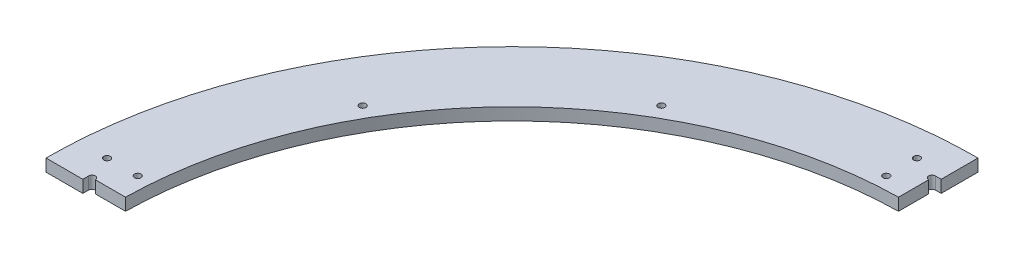
ISO-10303-21;
HEADER;
FILE_DESCRIPTION(('STEP AP214'),'2;1');
FILE_NAME('part.step','',(''),(''),'','','');
FILE_SCHEMA(('AUTOMOTIVE_DESIGN { 1 0 10303 214 1 1 1 1 }'));
ENDSEC;
DATA;
#1=APPLICATION_CONTEXT('core data for automotive mechanical design processes');
#2=APPLICATION_PROTOCOL_DEFINITION('international standard','automotive_design',2000,#1);
#3=PRODUCT_CONTEXT('',#1,'mechanical');
#4=PRODUCT('Part','Part','',(#3));
#5=PRODUCT_RELATED_PRODUCT_CATEGORY('part','',(#4));
#6=PRODUCT_DEFINITION_FORMATION('','',#4);
#7=PRODUCT_DEFINITION_CONTEXT('part definition',#1,'design');
#8=PRODUCT_DEFINITION('design','',#6,#7);
#9=PRODUCT_DEFINITION_SHAPE('','',#8);
#10=(LENGTH_UNIT() NAMED_UNIT(*) SI_UNIT(.MILLI.,.METRE.));
#11=(NAMED_UNIT(*) PLANE_ANGLE_UNIT() SI_UNIT($,.RADIAN.));
#12=(NAMED_UNIT(*) SI_UNIT($,.STERADIAN.) SOLID_ANGLE_UNIT());
#13=UNCERTAINTY_MEASURE_WITH_UNIT(LENGTH_MEASURE(1.E-05),#10,'distance_accuracy_value','');
#14=(GEOMETRIC_REPRESENTATION_CONTEXT(3) GLOBAL_UNCERTAINTY_ASSIGNED_CONTEXT((#13)) GLOBAL_UNIT_ASSIGNED_CONTEXT((#10,
#11,#12)) REPRESENTATION_CONTEXT('',''));
#15=CARTESIAN_POINT('',(0.,0.,0.));
#16=DIRECTION('',(0.,0.,1.));
#17=DIRECTION('',(1.,0.,0.));
#18=AXIS2_PLACEMENT_3D('',#15,#16,#17);
#19=CARTESIAN_POINT('',(0.,0.,0.));
#20=DIRECTION('',(0.,-1.,0.));
#21=DIRECTION('',(0.,0.,-1.));
#22=AXIS2_PLACEMENT_3D('',#19,#20,#21);
#23=PLANE('',#22);
#24=DIRECTION('',(0.,0.,1.));
#25=VECTOR('',#24,1.);
#26=CARTESIAN_POINT('',(-0.317499999999999,0.,-482.6));
#27=LINE('',#26,#25);
#28=CARTESIAN_POINT('',(-0.317499999999999,0.,-482.599895559199));
#29=VERTEX_POINT('',#28);
#30=CARTESIAN_POINT('',(-0.317499999999995,0.,-444.5));
#31=VERTEX_POINT('',#30);
#32=EDGE_CURVE('E109',#29,#31,#27,.T.);
#33=ORIENTED_EDGE('',*,*,#32,.T.);
#34=DIRECTION('',(-1.,0.,0.));
#35=VECTOR('',#34,1.);
#36=CARTESIAN_POINT('',(-6.35,0.,-444.5));
#37=LINE('',#36,#35);
#38=CARTESIAN_POINT('',(-6.35,0.,-444.5));
#39=VERTEX_POINT('',#38);
#40=EDGE_CURVE('E120',#31,#39,#37,.T.);
#41=ORIENTED_EDGE('',*,*,#40,.T.);
#42=CARTESIAN_POINT('',(-6.35,0.,-441.071));
#43=DIRECTION('',(0.,1.,0.));
#44=DIRECTION('',(0.,0.,1.));
#45=AXIS2_PLACEMENT_3D('',#42,#43,#44);
#46=CIRCLE('',#45,3.429);
#47=CARTESIAN_POINT('',(-6.35,0.,-437.642));
#48=VERTEX_POINT('',#47);
#49=EDGE_CURVE('E214',#39,#48,#46,.T.);
#50=ORIENTED_EDGE('',*,*,#49,.T.);
#51=DIRECTION('',(0.,0.,1.));
#52=VECTOR('',#51,1.);
#53=CARTESIAN_POINT('',(-6.35,0.,-406.350387596714));
#54=LINE('',#53,#52);
#55=CARTESIAN_POINT('',(-6.35,0.,-406.350387596714));
#56=VERTEX_POINT('',#55);
#57=EDGE_CURVE('E130',#48,#56,#54,.T.);
#58=ORIENTED_EDGE('',*,*,#57,.T.);
#59=CARTESIAN_POINT('',(0.,0.,0.));
#60=DIRECTION('',(0.,-1.,0.));
#61=DIRECTION('',(0.,0.,-1.));
#62=AXIS2_PLACEMENT_3D('',#59,#60,#61);
#63=CIRCLE('',#62,406.4);
#64=CARTESIAN_POINT('',(-406.350387596714,0.,-6.34999999999993));
#65=VERTEX_POINT('',#64);
#66=EDGE_CURVE('E142',#65,#56,#63,.T.);
#67=ORIENTED_EDGE('',*,*,#66,.F.);
#68=DIRECTION('',(-1.,0.,0.));
#69=VECTOR('',#68,1.);
#70=CARTESIAN_POINT('',(-406.350387596714,0.,-6.34999999999993));
#71=LINE('',#70,#69);
#72=CARTESIAN_POINT('',(-437.642,0.,-6.34999999999992));
#73=VERTEX_POINT('',#72);
#74=EDGE_CURVE('E144',#65,#73,#71,.T.);
#75=ORIENTED_EDGE('',*,*,#74,.T.);
#76=CARTESIAN_POINT('',(-441.071,0.,-6.34999999999992));
#77=DIRECTION('',(0.,1.,0.));
#78=DIRECTION('',(0.,0.,1.));
#79=AXIS2_PLACEMENT_3D('',#76,#77,#78);
#80=CIRCLE('',#79,3.42899999999994);
#81=CARTESIAN_POINT('',(-444.5,0.,-6.34999999999992));
#82=VERTEX_POINT('',#81);
#83=EDGE_CURVE('E215',#73,#82,#80,.T.);
#84=ORIENTED_EDGE('',*,*,#83,.T.);
#85=DIRECTION('',(0.,0.,1.));
#86=VECTOR('',#85,1.);
#87=CARTESIAN_POINT('',(-444.5,0.,6.35000000000008));
#88=LINE('',#87,#86);
#89=CARTESIAN_POINT('',(-444.5,0.,-0.317500000000082));
#90=VERTEX_POINT('',#89);
#91=EDGE_CURVE('E147',#82,#90,#88,.T.);
#92=ORIENTED_EDGE('',*,*,#91,.T.);
#93=DIRECTION('',(-1.,0.,0.));
#94=VECTOR('',#93,1.);
#95=CARTESIAN_POINT('',(-482.6,0.,-0.317500000000082));
#96=LINE('',#95,#94);
#97=CARTESIAN_POINT('',(-482.599895559199,0.,-0.317500000000082));
#98=VERTEX_POINT('',#97);
#99=EDGE_CURVE('E47',#90,#98,#96,.T.);
#100=ORIENTED_EDGE('',*,*,#99,.T.);
#101=CARTESIAN_POINT('',(0.,0.,0.));
#102=DIRECTION('',(0.,1.,0.));
#103=DIRECTION('',(0.,0.,-1.));
#104=AXIS2_PLACEMENT_3D('',#101,#102,#103);
#105=CIRCLE('',#104,482.6);
#106=EDGE_CURVE('E123',#29,#98,#105,.T.);
#107=ORIENTED_EDGE('',*,*,#106,.F.);
#108=EDGE_LOOP('',(#33,#41,#50,#58,#67,#75,#84,#92,#100,#107));
#109=FACE_BOUND('',#108,.T.);
#110=CARTESIAN_POINT('',(-31.75,0.,-419.1));
#111=DIRECTION('',(0.,1.,0.));
#112=DIRECTION('',(0.,0.,1.));
#113=AXIS2_PLACEMENT_3D('',#110,#111,#112);
#114=CIRCLE('',#113,3.3782);
#115=CARTESIAN_POINT('',(-31.75,0.,-415.7218));
#116=VERTEX_POINT('',#115);
#117=EDGE_CURVE('E181',#116,#116,#114,.T.);
#118=ORIENTED_EDGE('',*,*,#117,.T.);
#119=EDGE_LOOP('',(#118));
#120=FACE_BOUND('',#119,.T.);
#121=CARTESIAN_POINT('',(-365.700877383074,0.,-211.1375));
#122=DIRECTION('',(0.,1.,0.));
#123=DIRECTION('',(0.,0.,1.));
#124=AXIS2_PLACEMENT_3D('',#121,#122,#123);
#125=CIRCLE('',#124,3.3782);
#126=CARTESIAN_POINT('',(-365.700877383074,0.,-207.7593));
#127=VERTEX_POINT('',#126);
#128=EDGE_CURVE('E211',#127,#127,#125,.T.);
#129=ORIENTED_EDGE('',*,*,#128,.T.);
#130=EDGE_LOOP('',(#129));
#131=FACE_BOUND('',#130,.T.);
#132=CARTESIAN_POINT('',(-211.1375,0.,-365.700877383074));
#133=DIRECTION('',(0.,1.,0.));
#134=DIRECTION('',(0.,0.,1.));
#135=AXIS2_PLACEMENT_3D('',#132,#133,#134);
#136=CIRCLE('',#135,3.3782);
#137=CARTESIAN_POINT('',(-211.1375,0.,-362.322677383074));
#138=VERTEX_POINT('',#137);
#139=EDGE_CURVE('E205',#138,#138,#136,.T.);
#140=ORIENTED_EDGE('',*,*,#139,.T.);
#141=EDGE_LOOP('',(#140));
#142=FACE_BOUND('',#141,.T.);
#143=CARTESIAN_POINT('',(-450.85,0.,-31.75));
#144=DIRECTION('',(0.,1.,0.));
#145=DIRECTION('',(0.,0.,1.));
#146=AXIS2_PLACEMENT_3D('',#143,#144,#145);
#147=CIRCLE('',#146,3.3782);
#148=CARTESIAN_POINT('',(-450.85,0.,-28.3718));
#149=VERTEX_POINT('',#148);
#150=EDGE_CURVE('E199',#149,#149,#147,.T.);
#151=ORIENTED_EDGE('',*,*,#150,.T.);
#152=EDGE_LOOP('',(#151));
#153=FACE_BOUND('',#152,.T.);
#154=CARTESIAN_POINT('',(-419.1,0.,-31.75));
#155=DIRECTION('',(0.,1.,0.));
#156=DIRECTION('',(0.,0.,1.));
#157=AXIS2_PLACEMENT_3D('',#154,#155,#156);
#158=CIRCLE('',#157,3.3782);
#159=CARTESIAN_POINT('',(-419.1,0.,-28.3718));
#160=VERTEX_POINT('',#159);
#161=EDGE_CURVE('E193',#160,#160,#158,.T.);
#162=ORIENTED_EDGE('',*,*,#161,.T.);
#163=EDGE_LOOP('',(#162));
#164=FACE_BOUND('',#163,.T.);
#165=CARTESIAN_POINT('',(-31.75,0.,-450.85));
#166=DIRECTION('',(0.,1.,0.));
#167=DIRECTION('',(0.,0.,1.));
#168=AXIS2_PLACEMENT_3D('',#165,#166,#167);
#169=CIRCLE('',#168,3.3782);
#170=CARTESIAN_POINT('',(-31.75,0.,-447.4718));
#171=VERTEX_POINT('',#170);
#172=EDGE_CURVE('E187',#171,#171,#169,.T.);
#173=ORIENTED_EDGE('',*,*,#172,.T.);
#174=EDGE_LOOP('',(#173));
#175=FACE_BOUND('',#174,.T.);
#176=ADVANCED_FACE('F32',(#109,#120,#131,#142,#153,#164,#175),#23,.T.);
#177=CARTESIAN_POINT('',(0.,12.7,0.));
#178=DIRECTION('',(0.,-1.,0.));
#179=DIRECTION('',(0.,0.,-1.));
#180=AXIS2_PLACEMENT_3D('',#177,#178,#179);
#181=PLANE('',#180);
#182=CARTESIAN_POINT('',(-31.75,12.7,-419.1));
#183=DIRECTION('',(0.,1.,0.));
#184=DIRECTION('',(0.,0.,1.));
#185=AXIS2_PLACEMENT_3D('',#182,#183,#184);
#186=CIRCLE('',#185,3.3782);
#187=CARTESIAN_POINT('',(-31.75,12.7,-415.7218));
#188=VERTEX_POINT('',#187);
#189=EDGE_CURVE('E173',#188,#188,#186,.T.);
#190=ORIENTED_EDGE('',*,*,#189,.F.);
#191=EDGE_LOOP('',(#190));
#192=FACE_BOUND('',#191,.T.);
#193=CARTESIAN_POINT('',(-31.75,12.7,-450.85));
#194=DIRECTION('',(0.,1.,0.));
#195=DIRECTION('',(0.,0.,1.));
#196=AXIS2_PLACEMENT_3D('',#193,#194,#195);
#197=CIRCLE('',#196,3.3782);
#198=CARTESIAN_POINT('',(-31.75,12.7,-447.4718));
#199=VERTEX_POINT('',#198);
#200=EDGE_CURVE('E184',#199,#199,#197,.T.);
#201=ORIENTED_EDGE('',*,*,#200,.F.);
#202=EDGE_LOOP('',(#201));
#203=FACE_BOUND('',#202,.T.);
#204=CARTESIAN_POINT('',(-419.1,12.7,-31.75));
#205=DIRECTION('',(0.,1.,0.));
#206=DIRECTION('',(0.,0.,1.));
#207=AXIS2_PLACEMENT_3D('',#204,#205,#206);
#208=CIRCLE('',#207,3.3782);
#209=CARTESIAN_POINT('',(-419.1,12.7,-28.3718));
#210=VERTEX_POINT('',#209);
#211=EDGE_CURVE('E190',#210,#210,#208,.T.);
#212=ORIENTED_EDGE('',*,*,#211,.F.);
#213=EDGE_LOOP('',(#212));
#214=FACE_BOUND('',#213,.T.);
#215=CARTESIAN_POINT('',(-450.85,12.7,-31.75));
#216=DIRECTION('',(0.,1.,0.));
#217=DIRECTION('',(0.,0.,1.));
#218=AXIS2_PLACEMENT_3D('',#215,#216,#217);
#219=CIRCLE('',#218,3.3782);
#220=CARTESIAN_POINT('',(-450.85,12.7,-28.3718));
#221=VERTEX_POINT('',#220);
#222=EDGE_CURVE('E196',#221,#221,#219,.T.);
#223=ORIENTED_EDGE('',*,*,#222,.F.);
#224=EDGE_LOOP('',(#223));
#225=FACE_BOUND('',#224,.T.);
#226=CARTESIAN_POINT('',(-211.1375,12.7,-365.700877383074));
#227=DIRECTION('',(0.,1.,0.));
#228=DIRECTION('',(0.,0.,1.));
#229=AXIS2_PLACEMENT_3D('',#226,#227,#228);
#230=CIRCLE('',#229,3.3782);
#231=CARTESIAN_POINT('',(-211.1375,12.7,-362.322677383074));
#232=VERTEX_POINT('',#231);
#233=EDGE_CURVE('E202',#232,#232,#230,.T.);
#234=ORIENTED_EDGE('',*,*,#233,.F.);
#235=EDGE_LOOP('',(#234));
#236=FACE_BOUND('',#235,.T.);
#237=CARTESIAN_POINT('',(-365.700877383074,12.7,-211.1375));
#238=DIRECTION('',(0.,1.,0.));
#239=DIRECTION('',(0.,0.,1.));
#240=AXIS2_PLACEMENT_3D('',#237,#238,#239);
#241=CIRCLE('',#240,3.3782);
#242=CARTESIAN_POINT('',(-365.700877383074,12.7,-207.7593));
#243=VERTEX_POINT('',#242);
#244=EDGE_CURVE('E208',#243,#243,#241,.T.);
#245=ORIENTED_EDGE('',*,*,#244,.F.);
#246=EDGE_LOOP('',(#245));
#247=FACE_BOUND('',#246,.T.);
#248=DIRECTION('',(-1.,0.,0.));
#249=VECTOR('',#248,1.);
#250=CARTESIAN_POINT('',(-6.35,12.7,-444.5));
#251=LINE('',#250,#249);
#252=CARTESIAN_POINT('',(-0.317499999999999,12.7,-444.5));
#253=VERTEX_POINT('',#252);
#254=CARTESIAN_POINT('',(-6.35,12.7,-444.5));
#255=VERTEX_POINT('',#254);
#256=EDGE_CURVE('E134',#253,#255,#251,.T.);
#257=ORIENTED_EDGE('',*,*,#256,.F.);
#258=DIRECTION('',(0.,0.,1.));
#259=VECTOR('',#258,1.);
#260=CARTESIAN_POINT('',(-0.317499999999999,12.7,-482.6));
#261=LINE('',#260,#259);
#262=CARTESIAN_POINT('',(-0.317499999999999,12.7,-482.599895559199));
#263=VERTEX_POINT('',#262);
#264=EDGE_CURVE('E55',#263,#253,#261,.T.);
#265=ORIENTED_EDGE('',*,*,#264,.F.);
#266=CARTESIAN_POINT('',(0.,12.7,0.));
#267=DIRECTION('',(0.,1.,0.));
#268=DIRECTION('',(0.,0.,-1.));
#269=AXIS2_PLACEMENT_3D('',#266,#267,#268);
#270=CIRCLE('',#269,482.6);
#271=CARTESIAN_POINT('',(-482.599895559199,12.7,-0.317500000000082));
#272=VERTEX_POINT('',#271);
#273=EDGE_CURVE('E40',#263,#272,#270,.T.);
#274=ORIENTED_EDGE('',*,*,#273,.T.);
#275=DIRECTION('',(-1.,0.,0.));
#276=VECTOR('',#275,1.);
#277=CARTESIAN_POINT('',(-482.6,12.7,-0.317500000000082));
#278=LINE('',#277,#276);
#279=CARTESIAN_POINT('',(-444.5,12.7,-0.317500000000026));
#280=VERTEX_POINT('',#279);
#281=EDGE_CURVE('E426',#280,#272,#278,.T.);
#282=ORIENTED_EDGE('',*,*,#281,.F.);
#283=DIRECTION('',(0.,0.,1.));
#284=VECTOR('',#283,1.);
#285=CARTESIAN_POINT('',(-444.5,12.7,6.35000000000008));
#286=LINE('',#285,#284);
#287=CARTESIAN_POINT('',(-444.5,12.7,-6.34999999999992));
#288=VERTEX_POINT('',#287);
#289=EDGE_CURVE('E148',#288,#280,#286,.T.);
#290=ORIENTED_EDGE('',*,*,#289,.F.);
#291=CARTESIAN_POINT('',(-441.071,12.7,-6.34999999999992));
#292=DIRECTION('',(0.,1.,0.));
#293=DIRECTION('',(0.,0.,1.));
#294=AXIS2_PLACEMENT_3D('',#291,#292,#293);
#295=CIRCLE('',#294,3.42899999999994);
#296=CARTESIAN_POINT('',(-437.642,12.7,-6.34999999999992));
#297=VERTEX_POINT('',#296);
#298=EDGE_CURVE('E218',#297,#288,#295,.T.);
#299=ORIENTED_EDGE('',*,*,#298,.F.);
#300=DIRECTION('',(-1.,0.,0.));
#301=VECTOR('',#300,1.);
#302=CARTESIAN_POINT('',(-406.350387596714,12.7,-6.34999999999993));
#303=LINE('',#302,#301);
#304=CARTESIAN_POINT('',(-406.350387596714,12.7,-6.34999999999993));
#305=VERTEX_POINT('',#304);
#306=EDGE_CURVE('E152',#305,#297,#303,.T.);
#307=ORIENTED_EDGE('',*,*,#306,.F.);
#308=CARTESIAN_POINT('',(0.,12.7,0.));
#309=DIRECTION('',(0.,-1.,0.));
#310=DIRECTION('',(0.,0.,-1.));
#311=AXIS2_PLACEMENT_3D('',#308,#309,#310);
#312=CIRCLE('',#311,406.4);
#313=CARTESIAN_POINT('',(-6.35,12.7,-406.350387596714));
#314=VERTEX_POINT('',#313);
#315=EDGE_CURVE('E161',#305,#314,#312,.T.);
#316=ORIENTED_EDGE('',*,*,#315,.T.);
#317=DIRECTION('',(0.,0.,1.));
#318=VECTOR('',#317,1.);
#319=CARTESIAN_POINT('',(-6.35,12.7,-406.350387596714));
#320=LINE('',#319,#318);
#321=CARTESIAN_POINT('',(-6.35,12.7,-437.642));
#322=VERTEX_POINT('',#321);
#323=EDGE_CURVE('E138',#322,#314,#320,.T.);
#324=ORIENTED_EDGE('',*,*,#323,.F.);
#325=CARTESIAN_POINT('',(-6.35,12.7,-441.071));
#326=DIRECTION('',(0.,1.,0.));
#327=DIRECTION('',(0.,0.,1.));
#328=AXIS2_PLACEMENT_3D('',#325,#326,#327);
#329=CIRCLE('',#328,3.429);
#330=EDGE_CURVE('E220',#255,#322,#329,.T.);
#331=ORIENTED_EDGE('',*,*,#330,.F.);
#332=EDGE_LOOP('',(#257,#265,#274,#282,#290,#299,#307,#316,#324,#331));
#333=FACE_BOUND('',#332,.T.);
#334=ADVANCED_FACE('F231',(#192,#203,#214,#225,#236,#247,#333),#181,.F.);
#335=CARTESIAN_POINT('',(0.,12.7,0.));
#336=DIRECTION('',(0.,-1.,0.));
#337=DIRECTION('',(0.,0.,-1.));
#338=AXIS2_PLACEMENT_3D('',#335,#336,#337);
#339=CYLINDRICAL_SURFACE('',#338,406.4);
#340=ORIENTED_EDGE('',*,*,#66,.T.);
#341=DIRECTION('',(0.,1.,0.));
#342=VECTOR('',#341,1.);
#343=CARTESIAN_POINT('',(-6.35,0.,-406.350387596714));
#344=LINE('',#343,#342);
#345=EDGE_CURVE('E129',#56,#314,#344,.T.);
#346=ORIENTED_EDGE('',*,*,#345,.T.);
#347=ORIENTED_EDGE('',*,*,#315,.F.);
#348=DIRECTION('',(0.,1.,0.));
#349=VECTOR('',#348,1.);
#350=CARTESIAN_POINT('',(-406.350387596714,0.,-6.34999999999993));
#351=LINE('',#350,#349);
#352=EDGE_CURVE('E151',#65,#305,#351,.T.);
#353=ORIENTED_EDGE('',*,*,#352,.F.);
#354=EDGE_LOOP('',(#340,#346,#347,#353));
#355=FACE_BOUND('',#354,.T.);
#356=ADVANCED_FACE('F34',(#355),#339,.F.);
#357=CARTESIAN_POINT('',(0.,12.7,0.));
#358=DIRECTION('',(0.,-1.,0.));
#359=DIRECTION('',(0.,0.,-1.));
#360=AXIS2_PLACEMENT_3D('',#357,#358,#359);
#361=CYLINDRICAL_SURFACE('',#360,482.6);
#362=ORIENTED_EDGE('',*,*,#273,.F.);
#363=DIRECTION('',(0.,-1.,0.));
#364=VECTOR('',#363,1.);
#365=CARTESIAN_POINT('',(-0.317499999999999,12.7,-482.599895559199));
#366=LINE('',#365,#364);
#367=EDGE_CURVE('E114',#263,#29,#366,.T.);
#368=ORIENTED_EDGE('',*,*,#367,.T.);
#369=ORIENTED_EDGE('',*,*,#106,.T.);
#370=DIRECTION('',(0.,-1.,0.));
#371=VECTOR('',#370,1.);
#372=CARTESIAN_POINT('',(-482.599895559199,12.7,-0.317500000000082));
#373=LINE('',#372,#371);
#374=EDGE_CURVE('E171',#98,#272,#373,.F.);
#375=ORIENTED_EDGE('',*,*,#374,.T.);
#376=EDGE_LOOP('',(#362,#368,#369,#375));
#377=FACE_BOUND('',#376,.T.);
#378=ADVANCED_FACE('F170',(#377),#361,.T.);
#379=CARTESIAN_POINT('',(-444.5,0.,6.35000000000008));
#380=DIRECTION('',(-1.,0.,0.));
#381=DIRECTION('',(0.,0.,1.));
#382=AXIS2_PLACEMENT_3D('',#379,#380,#381);
#383=PLANE('',#382);
#384=ORIENTED_EDGE('',*,*,#289,.T.);
#385=DIRECTION('',(0.,1.,0.));
#386=VECTOR('',#385,1.);
#387=CARTESIAN_POINT('',(-444.5,0.,-0.317500000000026));
#388=LINE('',#387,#386);
#389=EDGE_CURVE('E176',#90,#280,#388,.T.);
#390=ORIENTED_EDGE('',*,*,#389,.F.);
#391=ORIENTED_EDGE('',*,*,#91,.F.);
#392=DIRECTION('',(0.,1.,0.));
#393=VECTOR('',#392,1.);
#394=CARTESIAN_POINT('',(-444.5,0.,-6.34999999999992));
#395=LINE('',#394,#393);
#396=EDGE_CURVE('E140',#82,#288,#395,.T.);
#397=ORIENTED_EDGE('',*,*,#396,.T.);
#398=EDGE_LOOP('',(#384,#390,#391,#397));
#399=FACE_BOUND('',#398,.T.);
#400=ADVANCED_FACE('F259',(#399),#383,.F.);
#401=CARTESIAN_POINT('',(-406.350387596714,0.,-6.34999999999993));
#402=DIRECTION('',(0.,0.,-1.));
#403=DIRECTION('',(-1.,0.,0.));
#404=AXIS2_PLACEMENT_3D('',#401,#402,#403);
#405=PLANE('',#404);
#406=ORIENTED_EDGE('',*,*,#306,.T.);
#407=DIRECTION('',(0.,1.,0.));
#408=VECTOR('',#407,1.);
#409=CARTESIAN_POINT('',(-437.642,0.,-6.34999999999992));
#410=LINE('',#409,#408);
#411=EDGE_CURVE('E11',#297,#73,#410,.F.);
#412=ORIENTED_EDGE('',*,*,#411,.T.);
#413=ORIENTED_EDGE('',*,*,#74,.F.);
#414=ORIENTED_EDGE('',*,*,#352,.T.);
#415=EDGE_LOOP('',(#406,#412,#413,#414));
#416=FACE_BOUND('',#415,.T.);
#417=ADVANCED_FACE('F264',(#416),#405,.F.);
#418=CARTESIAN_POINT('',(-6.35,0.,-406.350387596714));
#419=DIRECTION('',(-1.,0.,0.));
#420=DIRECTION('',(0.,0.,1.));
#421=AXIS2_PLACEMENT_3D('',#418,#419,#420);
#422=PLANE('',#421);
#423=ORIENTED_EDGE('',*,*,#57,.F.);
#424=DIRECTION('',(0.,1.,0.));
#425=VECTOR('',#424,1.);
#426=CARTESIAN_POINT('',(-6.35,0.,-437.642));
#427=LINE('',#426,#425);
#428=EDGE_CURVE('E155',#48,#322,#427,.T.);
#429=ORIENTED_EDGE('',*,*,#428,.T.);
#430=ORIENTED_EDGE('',*,*,#323,.T.);
#431=ORIENTED_EDGE('',*,*,#345,.F.);
#432=EDGE_LOOP('',(#423,#429,#430,#431));
#433=FACE_BOUND('',#432,.T.);
#434=ADVANCED_FACE('F226',(#433),#422,.F.);
#435=CARTESIAN_POINT('',(-6.35,0.,-444.5));
#436=DIRECTION('',(0.,0.,-1.));
#437=DIRECTION('',(-1.,0.,0.));
#438=AXIS2_PLACEMENT_3D('',#435,#436,#437);
#439=PLANE('',#438);
#440=ORIENTED_EDGE('',*,*,#40,.F.);
#441=DIRECTION('',(0.,1.,0.));
#442=VECTOR('',#441,1.);
#443=CARTESIAN_POINT('',(-0.317499999999995,0.,-444.5));
#444=LINE('',#443,#442);
#445=EDGE_CURVE('E106',#31,#253,#444,.T.);
#446=ORIENTED_EDGE('',*,*,#445,.T.);
#447=ORIENTED_EDGE('',*,*,#256,.T.);
#448=DIRECTION('',(0.,1.,0.));
#449=VECTOR('',#448,1.);
#450=CARTESIAN_POINT('',(-6.35,0.,-444.5));
#451=LINE('',#450,#449);
#452=EDGE_CURVE('E128',#39,#255,#451,.T.);
#453=ORIENTED_EDGE('',*,*,#452,.F.);
#454=EDGE_LOOP('',(#440,#446,#447,#453));
#455=FACE_BOUND('',#454,.T.);
#456=ADVANCED_FACE('F126',(#455),#439,.F.);
#457=CARTESIAN_POINT('',(-6.35,0.,-441.071));
#458=DIRECTION('',(0.,1.,0.));
#459=DIRECTION('',(0.,0.,1.));
#460=AXIS2_PLACEMENT_3D('',#457,#458,#459);
#461=CYLINDRICAL_SURFACE('',#460,3.429);
#462=ORIENTED_EDGE('',*,*,#49,.F.);
#463=ORIENTED_EDGE('',*,*,#452,.T.);
#464=ORIENTED_EDGE('',*,*,#330,.T.);
#465=ORIENTED_EDGE('',*,*,#428,.F.);
#466=EDGE_LOOP('',(#462,#463,#464,#465));
#467=FACE_BOUND('',#466,.T.);
#468=ADVANCED_FACE('F238',(#467),#461,.F.);
#469=CARTESIAN_POINT('',(-441.071,0.,-6.34999999999992));
#470=DIRECTION('',(0.,1.,0.));
#471=DIRECTION('',(0.,0.,1.));
#472=AXIS2_PLACEMENT_3D('',#469,#470,#471);
#473=CYLINDRICAL_SURFACE('',#472,3.42899999999994);
#474=ORIENTED_EDGE('',*,*,#83,.F.);
#475=ORIENTED_EDGE('',*,*,#411,.F.);
#476=ORIENTED_EDGE('',*,*,#298,.T.);
#477=ORIENTED_EDGE('',*,*,#396,.F.);
#478=EDGE_LOOP('',(#474,#475,#476,#477));
#479=FACE_BOUND('',#478,.T.);
#480=ADVANCED_FACE('F240',(#479),#473,.F.);
#481=CARTESIAN_POINT('',(-365.700877383074,12.7,-211.1375));
#482=DIRECTION('',(0.,1.,0.));
#483=DIRECTION('',(0.,0.,1.));
#484=AXIS2_PLACEMENT_3D('',#481,#482,#483);
#485=CYLINDRICAL_SURFACE('',#484,3.3782);
#486=ORIENTED_EDGE('',*,*,#128,.F.);
#487=EDGE_LOOP('',(#486));
#488=FACE_BOUND('',#487,.T.);
#489=ORIENTED_EDGE('',*,*,#244,.T.);
#490=EDGE_LOOP('',(#489));
#491=FACE_BOUND('',#490,.T.);
#492=ADVANCED_FACE('F246',(#488,#491),#485,.F.);
#493=CARTESIAN_POINT('',(-211.1375,12.7,-365.700877383074));
#494=DIRECTION('',(0.,1.,0.));
#495=DIRECTION('',(0.,0.,1.));
#496=AXIS2_PLACEMENT_3D('',#493,#494,#495);
#497=CYLINDRICAL_SURFACE('',#496,3.3782);
#498=ORIENTED_EDGE('',*,*,#139,.F.);
#499=EDGE_LOOP('',(#498));
#500=FACE_BOUND('',#499,.T.);
#501=ORIENTED_EDGE('',*,*,#233,.T.);
#502=EDGE_LOOP('',(#501));
#503=FACE_BOUND('',#502,.T.);
#504=ADVANCED_FACE('F336',(#500,#503),#497,.F.);
#505=CARTESIAN_POINT('',(-450.85,12.7,-31.75));
#506=DIRECTION('',(0.,1.,0.));
#507=DIRECTION('',(0.,0.,1.));
#508=AXIS2_PLACEMENT_3D('',#505,#506,#507);
#509=CYLINDRICAL_SURFACE('',#508,3.3782);
#510=ORIENTED_EDGE('',*,*,#150,.F.);
#511=EDGE_LOOP('',(#510));
#512=FACE_BOUND('',#511,.T.);
#513=ORIENTED_EDGE('',*,*,#222,.T.);
#514=EDGE_LOOP('',(#513));
#515=FACE_BOUND('',#514,.T.);
#516=ADVANCED_FACE('F332',(#512,#515),#509,.F.);
#517=CARTESIAN_POINT('',(-419.1,12.7,-31.75));
#518=DIRECTION('',(0.,1.,0.));
#519=DIRECTION('',(0.,0.,1.));
#520=AXIS2_PLACEMENT_3D('',#517,#518,#519);
#521=CYLINDRICAL_SURFACE('',#520,3.3782);
#522=ORIENTED_EDGE('',*,*,#161,.F.);
#523=EDGE_LOOP('',(#522));
#524=FACE_BOUND('',#523,.T.);
#525=ORIENTED_EDGE('',*,*,#211,.T.);
#526=EDGE_LOOP('',(#525));
#527=FACE_BOUND('',#526,.T.);
#528=ADVANCED_FACE('F328',(#524,#527),#521,.F.);
#529=CARTESIAN_POINT('',(-31.75,12.7,-450.85));
#530=DIRECTION('',(0.,1.,0.));
#531=DIRECTION('',(0.,0.,1.));
#532=AXIS2_PLACEMENT_3D('',#529,#530,#531);
#533=CYLINDRICAL_SURFACE('',#532,3.3782);
#534=ORIENTED_EDGE('',*,*,#172,.F.);
#535=EDGE_LOOP('',(#534));
#536=FACE_BOUND('',#535,.T.);
#537=ORIENTED_EDGE('',*,*,#200,.T.);
#538=EDGE_LOOP('',(#537));
#539=FACE_BOUND('',#538,.T.);
#540=ADVANCED_FACE('F324',(#536,#539),#533,.F.);
#541=CARTESIAN_POINT('',(-31.75,12.7,-419.1));
#542=DIRECTION('',(0.,1.,0.));
#543=DIRECTION('',(0.,0.,1.));
#544=AXIS2_PLACEMENT_3D('',#541,#542,#543);
#545=CYLINDRICAL_SURFACE('',#544,3.3782);
#546=ORIENTED_EDGE('',*,*,#117,.F.);
#547=EDGE_LOOP('',(#546));
#548=FACE_BOUND('',#547,.T.);
#549=ORIENTED_EDGE('',*,*,#189,.T.);
#550=EDGE_LOOP('',(#549));
#551=FACE_BOUND('',#550,.T.);
#552=ADVANCED_FACE('F308',(#548,#551),#545,.F.);
#553=CARTESIAN_POINT('',(-0.317499999999999,0.,-482.6));
#554=DIRECTION('',(-1.,0.,0.));
#555=DIRECTION('',(0.,0.,1.));
#556=AXIS2_PLACEMENT_3D('',#553,#554,#555);
#557=PLANE('',#556);
#558=ORIENTED_EDGE('',*,*,#264,.T.);
#559=ORIENTED_EDGE('',*,*,#445,.F.);
#560=ORIENTED_EDGE('',*,*,#32,.F.);
#561=ORIENTED_EDGE('',*,*,#367,.F.);
#562=EDGE_LOOP('',(#558,#559,#560,#561));
#563=FACE_BOUND('',#562,.T.);
#564=ADVANCED_FACE('F108',(#563),#557,.F.);
#565=CARTESIAN_POINT('',(-482.6,0.,-0.317500000000082));
#566=DIRECTION('',(0.,0.,-1.));
#567=DIRECTION('',(-1.,0.,0.));
#568=AXIS2_PLACEMENT_3D('',#565,#566,#567);
#569=PLANE('',#568);
#570=ORIENTED_EDGE('',*,*,#99,.F.);
#571=ORIENTED_EDGE('',*,*,#389,.T.);
#572=ORIENTED_EDGE('',*,*,#281,.T.);
#573=ORIENTED_EDGE('',*,*,#374,.F.);
#574=EDGE_LOOP('',(#570,#571,#572,#573));
#575=FACE_BOUND('',#574,.T.);
#576=ADVANCED_FACE('F307',(#575),#569,.F.);
#577=CLOSED_SHELL('',(#176,#334,#356,#378,#400,#417,#434,#456,#468,#480,#492,#504,#516,#528,
#540,#552,#564,#576));
#578=MANIFOLD_SOLID_BREP('B2',#577);
#579=ADVANCED_BREP_SHAPE_REPRESENTATION('',(#18,#578),#14);
#580=SHAPE_DEFINITION_REPRESENTATION(#9,#579);
ENDSEC;
END-ISO-10303-21;
